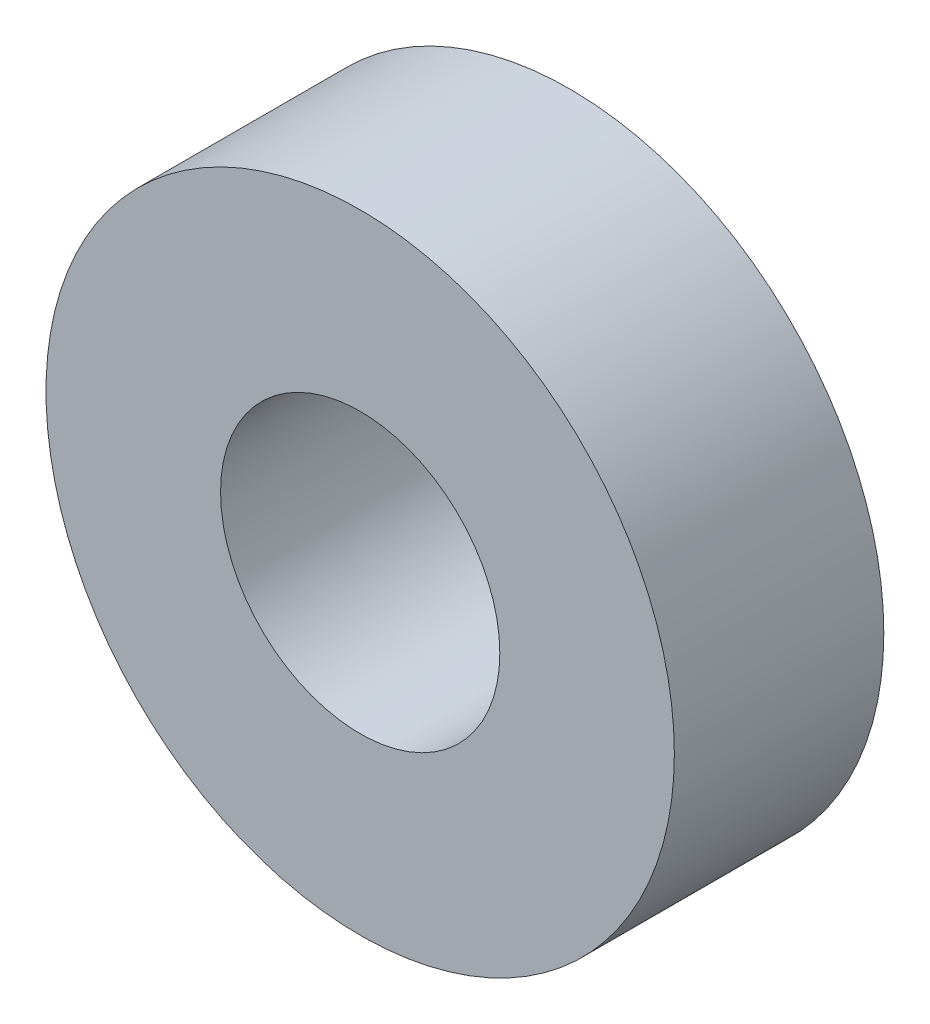
ISO-10303-21;
HEADER;
FILE_DESCRIPTION(('STEP AP214'),'2;1');
FILE_NAME('part.step','',(''),(''),'','','');
FILE_SCHEMA(('AUTOMOTIVE_DESIGN { 1 0 10303 214 1 1 1 1 }'));
ENDSEC;
DATA;
#1=APPLICATION_CONTEXT('core data for automotive mechanical design processes');
#2=APPLICATION_PROTOCOL_DEFINITION('international standard','automotive_design',2000,#1);
#3=PRODUCT_CONTEXT('',#1,'mechanical');
#4=PRODUCT('Part','Part','',(#3));
#5=PRODUCT_RELATED_PRODUCT_CATEGORY('part','',(#4));
#6=PRODUCT_DEFINITION_FORMATION('','',#4);
#7=PRODUCT_DEFINITION_CONTEXT('part definition',#1,'design');
#8=PRODUCT_DEFINITION('design','',#6,#7);
#9=PRODUCT_DEFINITION_SHAPE('','',#8);
#10=(LENGTH_UNIT() NAMED_UNIT(*) SI_UNIT(.MILLI.,.METRE.));
#11=(NAMED_UNIT(*) PLANE_ANGLE_UNIT() SI_UNIT($,.RADIAN.));
#12=(NAMED_UNIT(*) SI_UNIT($,.STERADIAN.) SOLID_ANGLE_UNIT());
#13=UNCERTAINTY_MEASURE_WITH_UNIT(LENGTH_MEASURE(1.E-05),#10,'distance_accuracy_value','');
#14=(GEOMETRIC_REPRESENTATION_CONTEXT(3) GLOBAL_UNCERTAINTY_ASSIGNED_CONTEXT((#13)) GLOBAL_UNIT_ASSIGNED_CONTEXT((#10,
#11,#12)) REPRESENTATION_CONTEXT('',''));
#15=CARTESIAN_POINT('',(0.,0.,0.));
#16=DIRECTION('',(0.,0.,1.));
#17=DIRECTION('',(1.,0.,0.));
#18=AXIS2_PLACEMENT_3D('',#15,#16,#17);
#19=CARTESIAN_POINT('',(0.,0.,1.5));
#20=DIRECTION('',(0.,0.,-1.));
#21=DIRECTION('',(-1.,0.,0.));
#22=AXIS2_PLACEMENT_3D('',#19,#20,#21);
#23=CYLINDRICAL_SURFACE('',#22,1.);
#24=CARTESIAN_POINT('',(0.,0.,1.5));
#25=DIRECTION('',(0.,0.,1.));
#26=DIRECTION('',(1.,0.,0.));
#27=AXIS2_PLACEMENT_3D('',#24,#25,#26);
#28=CIRCLE('',#27,1.);
#29=CARTESIAN_POINT('',(1.,0.,1.5));
#30=VERTEX_POINT('',#29);
#31=EDGE_CURVE('E49',#30,#30,#28,.T.);
#32=ORIENTED_EDGE('',*,*,#31,.T.);
#33=EDGE_LOOP('',(#32));
#34=FACE_BOUND('',#33,.T.);
#35=CARTESIAN_POINT('',(0.,0.,0.));
#36=DIRECTION('',(0.,0.,1.));
#37=DIRECTION('',(1.,0.,0.));
#38=AXIS2_PLACEMENT_3D('',#35,#36,#37);
#39=CIRCLE('',#38,1.);
#40=CARTESIAN_POINT('',(1.,0.,0.));
#41=VERTEX_POINT('',#40);
#42=EDGE_CURVE('E56',#41,#41,#39,.T.);
#43=ORIENTED_EDGE('',*,*,#42,.F.);
#44=EDGE_LOOP('',(#43));
#45=FACE_BOUND('',#44,.T.);
#46=ADVANCED_FACE('F41',(#34,#45),#23,.F.);
#47=CARTESIAN_POINT('',(0.,0.,1.5));
#48=DIRECTION('',(0.,0.,-1.));
#49=DIRECTION('',(-1.,0.,0.));
#50=AXIS2_PLACEMENT_3D('',#47,#48,#49);
#51=CYLINDRICAL_SURFACE('',#50,2.25);
#52=CARTESIAN_POINT('',(0.,0.,1.5));
#53=DIRECTION('',(0.,0.,1.));
#54=DIRECTION('',(1.,0.,0.));
#55=AXIS2_PLACEMENT_3D('',#52,#53,#54);
#56=CIRCLE('',#55,2.25);
#57=CARTESIAN_POINT('',(2.25,0.,1.5));
#58=VERTEX_POINT('',#57);
#59=EDGE_CURVE('E10',#58,#58,#56,.T.);
#60=ORIENTED_EDGE('',*,*,#59,.F.);
#61=EDGE_LOOP('',(#60));
#62=FACE_BOUND('',#61,.T.);
#63=CARTESIAN_POINT('',(0.,0.,0.));
#64=DIRECTION('',(0.,0.,1.));
#65=DIRECTION('',(1.,0.,0.));
#66=AXIS2_PLACEMENT_3D('',#63,#64,#65);
#67=CIRCLE('',#66,2.25);
#68=CARTESIAN_POINT('',(2.25,0.,0.));
#69=VERTEX_POINT('',#68);
#70=EDGE_CURVE('E44',#69,#69,#67,.T.);
#71=ORIENTED_EDGE('',*,*,#70,.T.);
#72=EDGE_LOOP('',(#71));
#73=FACE_BOUND('',#72,.T.);
#74=ADVANCED_FACE('F65',(#62,#73),#51,.T.);
#75=CARTESIAN_POINT('',(0.,0.,1.5));
#76=DIRECTION('',(0.,0.,1.));
#77=DIRECTION('',(1.,0.,0.));
#78=AXIS2_PLACEMENT_3D('',#75,#76,#77);
#79=PLANE('',#78);
#80=ORIENTED_EDGE('',*,*,#31,.F.);
#81=EDGE_LOOP('',(#80));
#82=FACE_BOUND('',#81,.T.);
#83=ORIENTED_EDGE('',*,*,#59,.T.);
#84=EDGE_LOOP('',(#83));
#85=FACE_BOUND('',#84,.T.);
#86=ADVANCED_FACE('F69',(#82,#85),#79,.T.);
#87=CARTESIAN_POINT('',(0.,0.,0.));
#88=DIRECTION('',(0.,0.,1.));
#89=DIRECTION('',(1.,0.,0.));
#90=AXIS2_PLACEMENT_3D('',#87,#88,#89);
#91=PLANE('',#90);
#92=ORIENTED_EDGE('',*,*,#42,.T.);
#93=EDGE_LOOP('',(#92));
#94=FACE_BOUND('',#93,.T.);
#95=ORIENTED_EDGE('',*,*,#70,.F.);
#96=EDGE_LOOP('',(#95));
#97=FACE_BOUND('',#96,.T.);
#98=ADVANCED_FACE('F67',(#94,#97),#91,.F.);
#99=CLOSED_SHELL('',(#46,#74,#86,#98));
#100=MANIFOLD_SOLID_BREP('B2',#99);
#101=ADVANCED_BREP_SHAPE_REPRESENTATION('',(#18,#100),#14);
#102=SHAPE_DEFINITION_REPRESENTATION(#9,#101);
ENDSEC;
END-ISO-10303-21;
